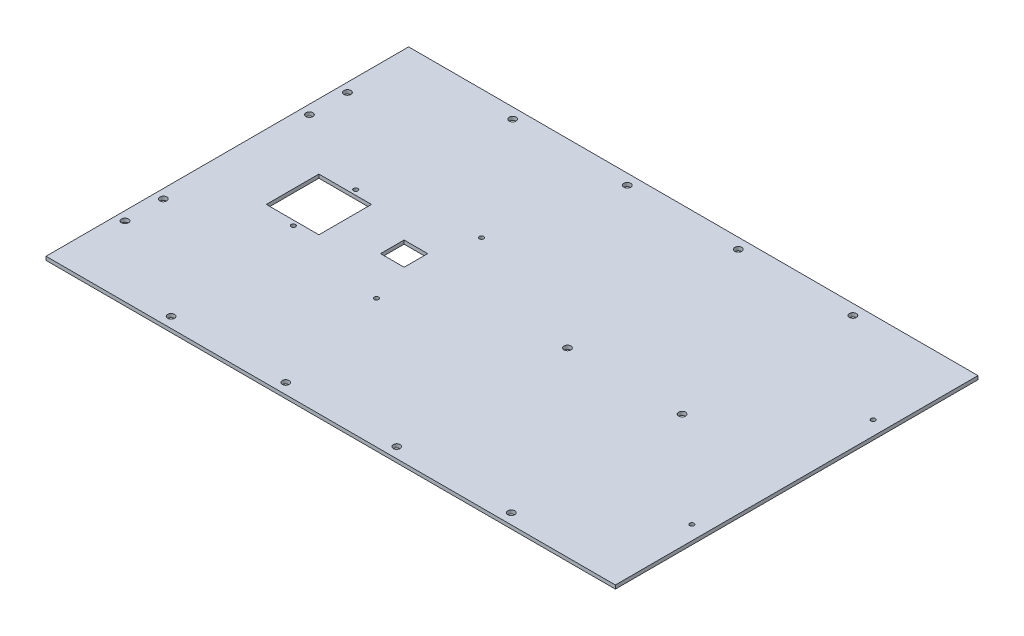
ISO-10303-21;
HEADER;
FILE_DESCRIPTION(('STEP AP214'),'2;1');
FILE_NAME('part.step','',(''),(''),'','','');
FILE_SCHEMA(('AUTOMOTIVE_DESIGN { 1 0 10303 214 1 1 1 1 }'));
ENDSEC;
DATA;
#1=APPLICATION_CONTEXT('core data for automotive mechanical design processes');
#2=APPLICATION_PROTOCOL_DEFINITION('international standard','automotive_design',2000,#1);
#3=PRODUCT_CONTEXT('',#1,'mechanical');
#4=PRODUCT('Part','Part','',(#3));
#5=PRODUCT_RELATED_PRODUCT_CATEGORY('part','',(#4));
#6=PRODUCT_DEFINITION_FORMATION('','',#4);
#7=PRODUCT_DEFINITION_CONTEXT('part definition',#1,'design');
#8=PRODUCT_DEFINITION('design','',#6,#7);
#9=PRODUCT_DEFINITION_SHAPE('','',#8);
#10=(LENGTH_UNIT() NAMED_UNIT(*) SI_UNIT(.MILLI.,.METRE.));
#11=(NAMED_UNIT(*) PLANE_ANGLE_UNIT() SI_UNIT($,.RADIAN.));
#12=(NAMED_UNIT(*) SI_UNIT($,.STERADIAN.) SOLID_ANGLE_UNIT());
#13=UNCERTAINTY_MEASURE_WITH_UNIT(LENGTH_MEASURE(1.E-05),#10,'distance_accuracy_value','');
#14=(GEOMETRIC_REPRESENTATION_CONTEXT(3) GLOBAL_UNCERTAINTY_ASSIGNED_CONTEXT((#13)) GLOBAL_UNIT_ASSIGNED_CONTEXT((#10,
#11,#12)) REPRESENTATION_CONTEXT('',''));
#15=CARTESIAN_POINT('',(0.,0.,0.));
#16=DIRECTION('',(0.,0.,1.));
#17=DIRECTION('',(1.,0.,0.));
#18=AXIS2_PLACEMENT_3D('',#15,#16,#17);
#19=CARTESIAN_POINT('',(0.,2.54,0.));
#20=DIRECTION('',(0.,1.,0.));
#21=DIRECTION('',(0.,0.,1.));
#22=AXIS2_PLACEMENT_3D('',#19,#20,#21);
#23=PLANE('',#22);
#24=CARTESIAN_POINT('',(189.484,2.54,0.));
#25=DIRECTION('',(0.,1.,0.));
#26=DIRECTION('',(0.,0.,1.));
#27=AXIS2_PLACEMENT_3D('',#24,#25,#26);
#28=CIRCLE('',#27,1.524);
#29=CARTESIAN_POINT('',(189.484,2.54,1.524));
#30=VERTEX_POINT('',#29);
#31=EDGE_CURVE('E613',#30,#30,#28,.T.);
#32=ORIENTED_EDGE('',*,*,#31,.F.);
#33=EDGE_LOOP('',(#32));
#34=FACE_BOUND('',#33,.T.);
#35=CARTESIAN_POINT('',(189.484,2.54,-127.));
#36=DIRECTION('',(0.,1.,0.));
#37=DIRECTION('',(0.,0.,1.));
#38=AXIS2_PLACEMENT_3D('',#35,#36,#37);
#39=CIRCLE('',#38,1.524);
#40=CARTESIAN_POINT('',(189.484,2.54,-125.476));
#41=VERTEX_POINT('',#40);
#42=EDGE_CURVE('E615',#41,#41,#39,.T.);
#43=ORIENTED_EDGE('',*,*,#42,.F.);
#44=EDGE_LOOP('',(#43));
#45=FACE_BOUND('',#44,.T.);
#46=CARTESIAN_POINT('',(-58.1660000000001,2.54,-100.33));
#47=DIRECTION('',(0.,1.,0.));
#48=DIRECTION('',(0.,0.,1.));
#49=AXIS2_PLACEMENT_3D('',#46,#47,#48);
#50=CIRCLE('',#49,1.52399999999998);
#51=CARTESIAN_POINT('',(-58.1660000000001,2.54,-98.8060000000001));
#52=VERTEX_POINT('',#51);
#53=EDGE_CURVE('E623',#52,#52,#50,.T.);
#54=ORIENTED_EDGE('',*,*,#53,.F.);
#55=EDGE_LOOP('',(#54));
#56=FACE_BOUND('',#55,.T.);
#57=CARTESIAN_POINT('',(-58.1660000000001,2.54,-26.6700000000001));
#58=DIRECTION('',(0.,1.,0.));
#59=DIRECTION('',(0.,0.,1.));
#60=AXIS2_PLACEMENT_3D('',#57,#58,#59);
#61=CIRCLE('',#60,1.52399999999998);
#62=CARTESIAN_POINT('',(-58.1660000000001,2.54,-25.1460000000001));
#63=VERTEX_POINT('',#62);
#64=EDGE_CURVE('E629',#63,#63,#61,.T.);
#65=ORIENTED_EDGE('',*,*,#64,.F.);
#66=EDGE_LOOP('',(#65));
#67=FACE_BOUND('',#66,.T.);
#68=CARTESIAN_POINT('',(-131.318,2.54,-41.656));
#69=DIRECTION('',(0.,1.,0.));
#70=DIRECTION('',(0.,0.,1.));
#71=AXIS2_PLACEMENT_3D('',#68,#69,#70);
#72=CIRCLE('',#71,1.524);
#73=CARTESIAN_POINT('',(-131.318,2.54,-40.132));
#74=VERTEX_POINT('',#73);
#75=EDGE_CURVE('E635',#74,#74,#72,.T.);
#76=ORIENTED_EDGE('',*,*,#75,.F.);
#77=EDGE_LOOP('',(#76));
#78=FACE_BOUND('',#77,.T.);
#79=CARTESIAN_POINT('',(-131.318,2.54,-85.344));
#80=DIRECTION('',(0.,1.,0.));
#81=DIRECTION('',(0.,0.,1.));
#82=AXIS2_PLACEMENT_3D('',#79,#80,#81);
#83=CIRCLE('',#82,1.524);
#84=CARTESIAN_POINT('',(-131.318,2.54,-83.82));
#85=VERTEX_POINT('',#84);
#86=EDGE_CURVE('E641',#85,#85,#83,.T.);
#87=ORIENTED_EDGE('',*,*,#86,.F.);
#88=EDGE_LOOP('',(#87));
#89=FACE_BOUND('',#88,.T.);
#90=CARTESIAN_POINT('',(119.126,2.54,-63.5000000000001));
#91=DIRECTION('',(0.,1.,0.));
#92=DIRECTION('',(0.,0.,1.));
#93=AXIS2_PLACEMENT_3D('',#90,#91,#92);
#94=CIRCLE('',#93,2.42569999999999);
#95=CARTESIAN_POINT('',(119.126,2.54,-61.0743000000001));
#96=VERTEX_POINT('',#95);
#97=EDGE_CURVE('E647',#96,#96,#94,.T.);
#98=ORIENTED_EDGE('',*,*,#97,.F.);
#99=EDGE_LOOP('',(#98));
#100=FACE_BOUND('',#99,.T.);
#101=CARTESIAN_POINT('',(38.8619999999999,2.54,-63.5000000000001));
#102=DIRECTION('',(0.,1.,0.));
#103=DIRECTION('',(0.,0.,1.));
#104=AXIS2_PLACEMENT_3D('',#101,#102,#103);
#105=CIRCLE('',#104,2.42569999999999);
#106=CARTESIAN_POINT('',(38.8619999999999,2.54,-61.0743000000001));
#107=VERTEX_POINT('',#106);
#108=EDGE_CURVE('E653',#107,#107,#105,.T.);
#109=ORIENTED_EDGE('',*,*,#108,.F.);
#110=EDGE_LOOP('',(#109));
#111=FACE_BOUND('',#110,.T.);
#112=CARTESIAN_POINT('',(-119.126,2.54,-183.127777467231));
#113=DIRECTION('',(0.,1.,0.));
#114=DIRECTION('',(0.,0.,1.));
#115=AXIS2_PLACEMENT_3D('',#112,#113,#114);
#116=CIRCLE('',#115,2.42569999999999);
#117=CARTESIAN_POINT('',(-119.126,2.54,-180.702077467232));
#118=VERTEX_POINT('',#117);
#119=EDGE_CURVE('E160',#118,#118,#116,.T.);
#120=ORIENTED_EDGE('',*,*,#119,.F.);
#121=EDGE_LOOP('',(#120));
#122=FACE_BOUND('',#121,.T.);
#123=CARTESIAN_POINT('',(-38.8620000000001,2.54,-183.127777467232));
#124=DIRECTION('',(0.,1.,0.));
#125=DIRECTION('',(0.,0.,1.));
#126=AXIS2_PLACEMENT_3D('',#123,#124,#125);
#127=CIRCLE('',#126,2.42569999999999);
#128=CARTESIAN_POINT('',(-38.8620000000001,2.54,-180.702077467232));
#129=VERTEX_POINT('',#128);
#130=EDGE_CURVE('E168',#129,#129,#127,.T.);
#131=ORIENTED_EDGE('',*,*,#130,.F.);
#132=EDGE_LOOP('',(#131));
#133=FACE_BOUND('',#132,.T.);
#134=CARTESIAN_POINT('',(38.8619999999999,2.54,-183.127777467232));
#135=DIRECTION('',(0.,1.,0.));
#136=DIRECTION('',(0.,0.,1.));
#137=AXIS2_PLACEMENT_3D('',#134,#135,#136);
#138=CIRCLE('',#137,2.42569999999999);
#139=CARTESIAN_POINT('',(38.8619999999999,2.54,-180.702077467232));
#140=VERTEX_POINT('',#139);
#141=EDGE_CURVE('E174',#140,#140,#138,.T.);
#142=ORIENTED_EDGE('',*,*,#141,.F.);
#143=EDGE_LOOP('',(#142));
#144=FACE_BOUND('',#143,.T.);
#145=CARTESIAN_POINT('',(119.126,2.54,-183.127777467232));
#146=DIRECTION('',(0.,1.,0.));
#147=DIRECTION('',(0.,0.,1.));
#148=AXIS2_PLACEMENT_3D('',#145,#146,#147);
#149=CIRCLE('',#148,2.42569999999999);
#150=CARTESIAN_POINT('',(119.126,2.54,-180.702077467232));
#151=VERTEX_POINT('',#150);
#152=EDGE_CURVE('E180',#151,#151,#149,.T.);
#153=ORIENTED_EDGE('',*,*,#152,.F.);
#154=EDGE_LOOP('',(#153));
#155=FACE_BOUND('',#154,.T.);
#156=CARTESIAN_POINT('',(-193.167,2.54,-141.4018));
#157=DIRECTION('',(0.,1.,0.));
#158=DIRECTION('',(0.,0.,1.));
#159=AXIS2_PLACEMENT_3D('',#156,#157,#158);
#160=CIRCLE('',#159,2.4257);
#161=CARTESIAN_POINT('',(-193.167,2.54,-138.9761));
#162=VERTEX_POINT('',#161);
#163=EDGE_CURVE('E186',#162,#162,#160,.T.);
#164=ORIENTED_EDGE('',*,*,#163,.F.);
#165=EDGE_LOOP('',(#164));
#166=FACE_BOUND('',#165,.T.);
#167=CARTESIAN_POINT('',(-193.04,2.54,-114.6556));
#168=DIRECTION('',(0.,1.,0.));
#169=DIRECTION('',(0.,0.,1.));
#170=AXIS2_PLACEMENT_3D('',#167,#168,#169);
#171=CIRCLE('',#170,2.4257);
#172=CARTESIAN_POINT('',(-193.04,2.54,-112.2299));
#173=VERTEX_POINT('',#172);
#174=EDGE_CURVE('E192',#173,#173,#171,.T.);
#175=ORIENTED_EDGE('',*,*,#174,.F.);
#176=EDGE_LOOP('',(#175));
#177=FACE_BOUND('',#176,.T.);
#178=DIRECTION('',(0.,0.,1.));
#179=VECTOR('',#178,1.);
#180=CARTESIAN_POINT('',(199.39,2.54,0.));
#181=LINE('',#180,#179);
#182=CARTESIAN_POINT('',(199.39,2.54,-190.5));
#183=VERTEX_POINT('',#182);
#184=CARTESIAN_POINT('',(199.39,2.54,63.5000000000001));
#185=VERTEX_POINT('',#184);
#186=EDGE_CURVE('E285',#183,#185,#181,.T.);
#187=ORIENTED_EDGE('',*,*,#186,.F.);
#188=DIRECTION('',(1.,0.,0.));
#189=VECTOR('',#188,1.);
#190=CARTESIAN_POINT('',(0.,2.54,-190.5));
#191=LINE('',#190,#189);
#192=CARTESIAN_POINT('',(-199.39,2.54,-190.5));
#193=VERTEX_POINT('',#192);
#194=EDGE_CURVE('E199',#193,#183,#191,.T.);
#195=ORIENTED_EDGE('',*,*,#194,.F.);
#196=DIRECTION('',(0.,0.,1.));
#197=VECTOR('',#196,1.);
#198=CARTESIAN_POINT('',(-199.39,2.54,0.));
#199=LINE('',#198,#197);
#200=CARTESIAN_POINT('',(-199.39,2.54,63.5));
#201=VERTEX_POINT('',#200);
#202=EDGE_CURVE('E279',#193,#201,#199,.T.);
#203=ORIENTED_EDGE('',*,*,#202,.T.);
#204=DIRECTION('',(1.,0.,0.));
#205=VECTOR('',#204,1.);
#206=CARTESIAN_POINT('',(0.,2.54,63.5000000000001));
#207=LINE('',#206,#205);
#208=EDGE_CURVE('E282',#201,#185,#207,.T.);
#209=ORIENTED_EDGE('',*,*,#208,.T.);
#210=EDGE_LOOP('',(#187,#195,#203,#209));
#211=FACE_BOUND('',#210,.T.);
#212=CARTESIAN_POINT('',(-119.126,2.54,56.1277774672314));
#213=DIRECTION('',(0.,1.,0.));
#214=DIRECTION('',(0.,0.,1.));
#215=AXIS2_PLACEMENT_3D('',#212,#213,#214);
#216=CIRCLE('',#215,2.42569999999999);
#217=CARTESIAN_POINT('',(-119.126,2.54,58.5534774672314));
#218=VERTEX_POINT('',#217);
#219=EDGE_CURVE('E241',#218,#218,#216,.T.);
#220=ORIENTED_EDGE('',*,*,#219,.F.);
#221=EDGE_LOOP('',(#220));
#222=FACE_BOUND('',#221,.T.);
#223=CARTESIAN_POINT('',(-38.862,2.54,56.1277774672314));
#224=DIRECTION('',(0.,1.,0.));
#225=DIRECTION('',(0.,0.,1.));
#226=AXIS2_PLACEMENT_3D('',#223,#224,#225);
#227=CIRCLE('',#226,2.42569999999999);
#228=CARTESIAN_POINT('',(-38.862,2.54,58.5534774672314));
#229=VERTEX_POINT('',#228);
#230=EDGE_CURVE('E248',#229,#229,#227,.T.);
#231=ORIENTED_EDGE('',*,*,#230,.F.);
#232=EDGE_LOOP('',(#231));
#233=FACE_BOUND('',#232,.T.);
#234=CARTESIAN_POINT('',(38.862,2.54,56.1277774672314));
#235=DIRECTION('',(0.,1.,0.));
#236=DIRECTION('',(0.,0.,1.));
#237=AXIS2_PLACEMENT_3D('',#234,#235,#236);
#238=CIRCLE('',#237,2.42569999999999);
#239=CARTESIAN_POINT('',(38.862,2.54,58.5534774672314));
#240=VERTEX_POINT('',#239);
#241=EDGE_CURVE('E254',#240,#240,#238,.T.);
#242=ORIENTED_EDGE('',*,*,#241,.F.);
#243=EDGE_LOOP('',(#242));
#244=FACE_BOUND('',#243,.T.);
#245=CARTESIAN_POINT('',(119.126,2.54,56.1277774672314));
#246=DIRECTION('',(0.,1.,0.));
#247=DIRECTION('',(0.,0.,1.));
#248=AXIS2_PLACEMENT_3D('',#245,#246,#247);
#249=CIRCLE('',#248,2.42569999999999);
#250=CARTESIAN_POINT('',(119.126,2.54,58.5534774672314));
#251=VERTEX_POINT('',#250);
#252=EDGE_CURVE('E260',#251,#251,#249,.T.);
#253=ORIENTED_EDGE('',*,*,#252,.F.);
#254=EDGE_LOOP('',(#253));
#255=FACE_BOUND('',#254,.T.);
#256=CARTESIAN_POINT('',(-193.167,2.54,14.4018));
#257=DIRECTION('',(0.,1.,0.));
#258=DIRECTION('',(0.,0.,1.));
#259=AXIS2_PLACEMENT_3D('',#256,#257,#258);
#260=CIRCLE('',#259,2.4257);
#261=CARTESIAN_POINT('',(-193.167,2.54,16.8275));
#262=VERTEX_POINT('',#261);
#263=EDGE_CURVE('E266',#262,#262,#260,.T.);
#264=ORIENTED_EDGE('',*,*,#263,.F.);
#265=EDGE_LOOP('',(#264));
#266=FACE_BOUND('',#265,.T.);
#267=CARTESIAN_POINT('',(-193.04,2.54,-12.3444));
#268=DIRECTION('',(0.,1.,0.));
#269=DIRECTION('',(0.,0.,1.));
#270=AXIS2_PLACEMENT_3D('',#267,#268,#269);
#271=CIRCLE('',#270,2.4257);
#272=CARTESIAN_POINT('',(-193.04,2.54,-9.9187));
#273=VERTEX_POINT('',#272);
#274=EDGE_CURVE('E272',#273,#273,#271,.T.);
#275=ORIENTED_EDGE('',*,*,#274,.F.);
#276=EDGE_LOOP('',(#275));
#277=FACE_BOUND('',#276,.T.);
#278=DIRECTION('',(0.,0.,1.));
#279=VECTOR('',#278,1.);
#280=CARTESIAN_POINT('',(-153.67,2.54,-63.5));
#281=LINE('',#280,#279);
#282=CARTESIAN_POINT('',(-153.67,2.54,-81.915));
#283=VERTEX_POINT('',#282);
#284=CARTESIAN_POINT('',(-153.67,2.54,-45.085));
#285=VERTEX_POINT('',#284);
#286=EDGE_CURVE('E222',#283,#285,#281,.T.);
#287=ORIENTED_EDGE('',*,*,#286,.F.);
#288=DIRECTION('',(1.,0.,0.));
#289=VECTOR('',#288,1.);
#290=CARTESIAN_POINT('',(-153.67,2.54,-81.915));
#291=LINE('',#290,#289);
#292=CARTESIAN_POINT('',(-116.84,2.54,-81.9150000000001));
#293=VERTEX_POINT('',#292);
#294=EDGE_CURVE('E147',#283,#293,#291,.T.);
#295=ORIENTED_EDGE('',*,*,#294,.T.);
#296=DIRECTION('',(0.,0.,-1.));
#297=VECTOR('',#296,1.);
#298=CARTESIAN_POINT('',(-116.84,2.54,-63.5));
#299=LINE('',#298,#297);
#300=CARTESIAN_POINT('',(-116.84,2.54,-45.085));
#301=VERTEX_POINT('',#300);
#302=EDGE_CURVE('E228',#301,#293,#299,.T.);
#303=ORIENTED_EDGE('',*,*,#302,.F.);
#304=DIRECTION('',(1.,0.,0.));
#305=VECTOR('',#304,1.);
#306=CARTESIAN_POINT('',(-153.67,2.54,-45.085));
#307=LINE('',#306,#305);
#308=EDGE_CURVE('E235',#285,#301,#307,.T.);
#309=ORIENTED_EDGE('',*,*,#308,.F.);
#310=EDGE_LOOP('',(#287,#295,#303,#309));
#311=FACE_BOUND('',#310,.T.);
#312=DIRECTION('',(0.,0.,1.));
#313=VECTOR('',#312,1.);
#314=CARTESIAN_POINT('',(-83.8200000000001,2.54,-63.5));
#315=LINE('',#314,#313);
#316=CARTESIAN_POINT('',(-83.8200000000001,2.54,-71.7550000000001));
#317=VERTEX_POINT('',#316);
#318=CARTESIAN_POINT('',(-83.8200000000001,2.54,-55.245));
#319=VERTEX_POINT('',#318);
#320=EDGE_CURVE('E210',#317,#319,#315,.T.);
#321=ORIENTED_EDGE('',*,*,#320,.F.);
#322=DIRECTION('',(1.,0.,0.));
#323=VECTOR('',#322,1.);
#324=CARTESIAN_POINT('',(-83.8200000000001,2.54,-71.7550000000001));
#325=LINE('',#324,#323);
#326=CARTESIAN_POINT('',(-67.3100000000001,2.54,-71.7550000000001));
#327=VERTEX_POINT('',#326);
#328=EDGE_CURVE('E141',#317,#327,#325,.T.);
#329=ORIENTED_EDGE('',*,*,#328,.T.);
#330=DIRECTION('',(0.,0.,-1.));
#331=VECTOR('',#330,1.);
#332=CARTESIAN_POINT('',(-67.3100000000001,2.54,-63.5));
#333=LINE('',#332,#331);
#334=CARTESIAN_POINT('',(-67.3100000000001,2.54,-55.245));
#335=VERTEX_POINT('',#334);
#336=EDGE_CURVE('E145',#335,#327,#333,.T.);
#337=ORIENTED_EDGE('',*,*,#336,.F.);
#338=DIRECTION('',(1.,0.,0.));
#339=VECTOR('',#338,1.);
#340=CARTESIAN_POINT('',(-83.8200000000001,2.54,-55.245));
#341=LINE('',#340,#339);
#342=EDGE_CURVE('E216',#319,#335,#341,.T.);
#343=ORIENTED_EDGE('',*,*,#342,.F.);
#344=EDGE_LOOP('',(#321,#329,#337,#343));
#345=FACE_BOUND('',#344,.T.);
#346=ADVANCED_FACE('F35',(#34,#45,#56,#67,#78,#89,#100,#111,#122,#133,#144,#155,#166,#177,#211,
#222,#233,#244,#255,#266,#277,#311,#345),#23,.T.);
#347=CARTESIAN_POINT('',(0.,0.,0.));
#348=DIRECTION('',(0.,1.,0.));
#349=DIRECTION('',(0.,0.,1.));
#350=AXIS2_PLACEMENT_3D('',#347,#348,#349);
#351=PLANE('',#350);
#352=CARTESIAN_POINT('',(189.484,0.,0.));
#353=DIRECTION('',(0.,1.,0.));
#354=DIRECTION('',(0.,0.,1.));
#355=AXIS2_PLACEMENT_3D('',#352,#353,#354);
#356=CIRCLE('',#355,1.524);
#357=CARTESIAN_POINT('',(189.484,0.,1.524));
#358=VERTEX_POINT('',#357);
#359=EDGE_CURVE('E611',#358,#358,#356,.T.);
#360=ORIENTED_EDGE('',*,*,#359,.T.);
#361=EDGE_LOOP('',(#360));
#362=FACE_BOUND('',#361,.T.);
#363=CARTESIAN_POINT('',(189.484,0.,-127.));
#364=DIRECTION('',(0.,1.,0.));
#365=DIRECTION('',(0.,0.,1.));
#366=AXIS2_PLACEMENT_3D('',#363,#364,#365);
#367=CIRCLE('',#366,1.524);
#368=CARTESIAN_POINT('',(189.484,0.,-125.476));
#369=VERTEX_POINT('',#368);
#370=EDGE_CURVE('E620',#369,#369,#367,.T.);
#371=ORIENTED_EDGE('',*,*,#370,.T.);
#372=EDGE_LOOP('',(#371));
#373=FACE_BOUND('',#372,.T.);
#374=CARTESIAN_POINT('',(-58.1660000000001,0.,-100.33));
#375=DIRECTION('',(0.,1.,0.));
#376=DIRECTION('',(0.,0.,1.));
#377=AXIS2_PLACEMENT_3D('',#374,#375,#376);
#378=CIRCLE('',#377,1.524);
#379=CARTESIAN_POINT('',(-58.1660000000001,0.,-98.8060000000001));
#380=VERTEX_POINT('',#379);
#381=EDGE_CURVE('E626',#380,#380,#378,.T.);
#382=ORIENTED_EDGE('',*,*,#381,.T.);
#383=EDGE_LOOP('',(#382));
#384=FACE_BOUND('',#383,.T.);
#385=CARTESIAN_POINT('',(-58.1660000000001,0.,-26.6700000000001));
#386=DIRECTION('',(0.,1.,0.));
#387=DIRECTION('',(0.,0.,1.));
#388=AXIS2_PLACEMENT_3D('',#385,#386,#387);
#389=CIRCLE('',#388,1.524);
#390=CARTESIAN_POINT('',(-58.1660000000001,0.,-25.1460000000001));
#391=VERTEX_POINT('',#390);
#392=EDGE_CURVE('E632',#391,#391,#389,.T.);
#393=ORIENTED_EDGE('',*,*,#392,.T.);
#394=EDGE_LOOP('',(#393));
#395=FACE_BOUND('',#394,.T.);
#396=CARTESIAN_POINT('',(-131.318,0.,-41.656));
#397=DIRECTION('',(0.,1.,0.));
#398=DIRECTION('',(0.,0.,1.));
#399=AXIS2_PLACEMENT_3D('',#396,#397,#398);
#400=CIRCLE('',#399,1.524);
#401=CARTESIAN_POINT('',(-131.318,0.,-40.132));
#402=VERTEX_POINT('',#401);
#403=EDGE_CURVE('E638',#402,#402,#400,.T.);
#404=ORIENTED_EDGE('',*,*,#403,.T.);
#405=EDGE_LOOP('',(#404));
#406=FACE_BOUND('',#405,.T.);
#407=CARTESIAN_POINT('',(-131.318,0.,-85.344));
#408=DIRECTION('',(0.,1.,0.));
#409=DIRECTION('',(0.,0.,1.));
#410=AXIS2_PLACEMENT_3D('',#407,#408,#409);
#411=CIRCLE('',#410,1.524);
#412=CARTESIAN_POINT('',(-131.318,0.,-83.82));
#413=VERTEX_POINT('',#412);
#414=EDGE_CURVE('E644',#413,#413,#411,.T.);
#415=ORIENTED_EDGE('',*,*,#414,.T.);
#416=EDGE_LOOP('',(#415));
#417=FACE_BOUND('',#416,.T.);
#418=CARTESIAN_POINT('',(119.126,0.,-63.5000000000001));
#419=DIRECTION('',(0.,1.,0.));
#420=DIRECTION('',(0.,0.,1.));
#421=AXIS2_PLACEMENT_3D('',#418,#419,#420);
#422=CIRCLE('',#421,2.4257);
#423=CARTESIAN_POINT('',(119.126,0.,-61.0743000000001));
#424=VERTEX_POINT('',#423);
#425=EDGE_CURVE('E650',#424,#424,#422,.T.);
#426=ORIENTED_EDGE('',*,*,#425,.T.);
#427=EDGE_LOOP('',(#426));
#428=FACE_BOUND('',#427,.T.);
#429=CARTESIAN_POINT('',(38.8619999999999,0.,-63.5000000000001));
#430=DIRECTION('',(0.,1.,0.));
#431=DIRECTION('',(0.,0.,1.));
#432=AXIS2_PLACEMENT_3D('',#429,#430,#431);
#433=CIRCLE('',#432,2.4257);
#434=CARTESIAN_POINT('',(38.8619999999999,0.,-61.0743000000001));
#435=VERTEX_POINT('',#434);
#436=EDGE_CURVE('E353',#435,#435,#433,.T.);
#437=ORIENTED_EDGE('',*,*,#436,.T.);
#438=EDGE_LOOP('',(#437));
#439=FACE_BOUND('',#438,.T.);
#440=DIRECTION('',(1.,0.,0.));
#441=VECTOR('',#440,1.);
#442=CARTESIAN_POINT('',(-153.67,0.,-81.915));
#443=LINE('',#442,#441);
#444=CARTESIAN_POINT('',(-153.67,0.,-81.915));
#445=VERTEX_POINT('',#444);
#446=CARTESIAN_POINT('',(-116.84,0.,-81.9150000000001));
#447=VERTEX_POINT('',#446);
#448=EDGE_CURVE('E151',#445,#447,#443,.T.);
#449=ORIENTED_EDGE('',*,*,#448,.F.);
#450=DIRECTION('',(0.,0.,1.));
#451=VECTOR('',#450,1.);
#452=CARTESIAN_POINT('',(-153.67,0.,-63.5));
#453=LINE('',#452,#451);
#454=CARTESIAN_POINT('',(-153.67,0.,-45.085));
#455=VERTEX_POINT('',#454);
#456=EDGE_CURVE('E224',#445,#455,#453,.T.);
#457=ORIENTED_EDGE('',*,*,#456,.T.);
#458=DIRECTION('',(1.,0.,0.));
#459=VECTOR('',#458,1.);
#460=CARTESIAN_POINT('',(-153.67,0.,-45.085));
#461=LINE('',#460,#459);
#462=CARTESIAN_POINT('',(-116.84,0.,-45.085));
#463=VERTEX_POINT('',#462);
#464=EDGE_CURVE('E227',#455,#463,#461,.T.);
#465=ORIENTED_EDGE('',*,*,#464,.T.);
#466=DIRECTION('',(0.,0.,-1.));
#467=VECTOR('',#466,1.);
#468=CARTESIAN_POINT('',(-116.84,0.,-63.5));
#469=LINE('',#468,#467);
#470=EDGE_CURVE('E58',#463,#447,#469,.T.);
#471=ORIENTED_EDGE('',*,*,#470,.T.);
#472=EDGE_LOOP('',(#449,#457,#465,#471));
#473=FACE_BOUND('',#472,.T.);
#474=CARTESIAN_POINT('',(-119.126,0.,-183.127777467231));
#475=DIRECTION('',(0.,1.,0.));
#476=DIRECTION('',(0.,0.,1.));
#477=AXIS2_PLACEMENT_3D('',#474,#475,#476);
#478=CIRCLE('',#477,2.4257);
#479=CARTESIAN_POINT('',(-119.126,0.,-180.702077467232));
#480=VERTEX_POINT('',#479);
#481=EDGE_CURVE('E165',#480,#480,#478,.T.);
#482=ORIENTED_EDGE('',*,*,#481,.T.);
#483=EDGE_LOOP('',(#482));
#484=FACE_BOUND('',#483,.T.);
#485=CARTESIAN_POINT('',(-38.8620000000001,0.,-183.127777467232));
#486=DIRECTION('',(0.,1.,0.));
#487=DIRECTION('',(0.,0.,1.));
#488=AXIS2_PLACEMENT_3D('',#485,#486,#487);
#489=CIRCLE('',#488,2.4257);
#490=CARTESIAN_POINT('',(-38.8620000000001,0.,-180.702077467232));
#491=VERTEX_POINT('',#490);
#492=EDGE_CURVE('E171',#491,#491,#489,.T.);
#493=ORIENTED_EDGE('',*,*,#492,.T.);
#494=EDGE_LOOP('',(#493));
#495=FACE_BOUND('',#494,.T.);
#496=CARTESIAN_POINT('',(38.8619999999999,0.,-183.127777467232));
#497=DIRECTION('',(0.,1.,0.));
#498=DIRECTION('',(0.,0.,1.));
#499=AXIS2_PLACEMENT_3D('',#496,#497,#498);
#500=CIRCLE('',#499,2.4257);
#501=CARTESIAN_POINT('',(38.8619999999999,0.,-180.702077467232));
#502=VERTEX_POINT('',#501);
#503=EDGE_CURVE('E177',#502,#502,#500,.T.);
#504=ORIENTED_EDGE('',*,*,#503,.T.);
#505=EDGE_LOOP('',(#504));
#506=FACE_BOUND('',#505,.T.);
#507=CARTESIAN_POINT('',(119.126,0.,-183.127777467232));
#508=DIRECTION('',(0.,1.,0.));
#509=DIRECTION('',(0.,0.,1.));
#510=AXIS2_PLACEMENT_3D('',#507,#508,#509);
#511=CIRCLE('',#510,2.4257);
#512=CARTESIAN_POINT('',(119.126,0.,-180.702077467232));
#513=VERTEX_POINT('',#512);
#514=EDGE_CURVE('E183',#513,#513,#511,.T.);
#515=ORIENTED_EDGE('',*,*,#514,.T.);
#516=EDGE_LOOP('',(#515));
#517=FACE_BOUND('',#516,.T.);
#518=CARTESIAN_POINT('',(-193.167,0.,-141.4018));
#519=DIRECTION('',(0.,1.,0.));
#520=DIRECTION('',(0.,0.,1.));
#521=AXIS2_PLACEMENT_3D('',#518,#519,#520);
#522=CIRCLE('',#521,2.4257);
#523=CARTESIAN_POINT('',(-193.167,0.,-138.9761));
#524=VERTEX_POINT('',#523);
#525=EDGE_CURVE('E189',#524,#524,#522,.T.);
#526=ORIENTED_EDGE('',*,*,#525,.T.);
#527=EDGE_LOOP('',(#526));
#528=FACE_BOUND('',#527,.T.);
#529=CARTESIAN_POINT('',(-193.04,0.,-114.6556));
#530=DIRECTION('',(0.,1.,0.));
#531=DIRECTION('',(0.,0.,1.));
#532=AXIS2_PLACEMENT_3D('',#529,#530,#531);
#533=CIRCLE('',#532,2.4257);
#534=CARTESIAN_POINT('',(-193.04,0.,-112.2299));
#535=VERTEX_POINT('',#534);
#536=EDGE_CURVE('E195',#535,#535,#533,.T.);
#537=ORIENTED_EDGE('',*,*,#536,.T.);
#538=EDGE_LOOP('',(#537));
#539=FACE_BOUND('',#538,.T.);
#540=DIRECTION('',(1.,0.,0.));
#541=VECTOR('',#540,1.);
#542=CARTESIAN_POINT('',(0.,0.,-190.5));
#543=LINE('',#542,#541);
#544=CARTESIAN_POINT('',(-199.39,0.,-190.5));
#545=VERTEX_POINT('',#544);
#546=CARTESIAN_POINT('',(199.39,0.,-190.5));
#547=VERTEX_POINT('',#546);
#548=EDGE_CURVE('E198',#545,#547,#543,.T.);
#549=ORIENTED_EDGE('',*,*,#548,.T.);
#550=DIRECTION('',(0.,0.,1.));
#551=VECTOR('',#550,1.);
#552=CARTESIAN_POINT('',(199.39,0.,0.));
#553=LINE('',#552,#551);
#554=CARTESIAN_POINT('',(199.39,0.,63.5000000000001));
#555=VERTEX_POINT('',#554);
#556=EDGE_CURVE('E283',#547,#555,#553,.T.);
#557=ORIENTED_EDGE('',*,*,#556,.T.);
#558=DIRECTION('',(1.,0.,0.));
#559=VECTOR('',#558,1.);
#560=CARTESIAN_POINT('',(0.,0.,63.5000000000001));
#561=LINE('',#560,#559);
#562=CARTESIAN_POINT('',(-199.39,0.,63.5));
#563=VERTEX_POINT('',#562);
#564=EDGE_CURVE('E290',#563,#555,#561,.T.);
#565=ORIENTED_EDGE('',*,*,#564,.F.);
#566=DIRECTION('',(0.,0.,1.));
#567=VECTOR('',#566,1.);
#568=CARTESIAN_POINT('',(-199.39,0.,0.));
#569=LINE('',#568,#567);
#570=EDGE_CURVE('E278',#545,#563,#569,.T.);
#571=ORIENTED_EDGE('',*,*,#570,.F.);
#572=EDGE_LOOP('',(#549,#557,#565,#571));
#573=FACE_BOUND('',#572,.T.);
#574=CARTESIAN_POINT('',(-119.126,0.,56.1277774672314));
#575=DIRECTION('',(0.,1.,0.));
#576=DIRECTION('',(0.,0.,1.));
#577=AXIS2_PLACEMENT_3D('',#574,#575,#576);
#578=CIRCLE('',#577,2.4257);
#579=CARTESIAN_POINT('',(-119.126,0.,58.5534774672314));
#580=VERTEX_POINT('',#579);
#581=EDGE_CURVE('E245',#580,#580,#578,.T.);
#582=ORIENTED_EDGE('',*,*,#581,.T.);
#583=EDGE_LOOP('',(#582));
#584=FACE_BOUND('',#583,.T.);
#585=CARTESIAN_POINT('',(-38.862,0.,56.1277774672314));
#586=DIRECTION('',(0.,1.,0.));
#587=DIRECTION('',(0.,0.,1.));
#588=AXIS2_PLACEMENT_3D('',#585,#586,#587);
#589=CIRCLE('',#588,2.4257);
#590=CARTESIAN_POINT('',(-38.862,0.,58.5534774672314));
#591=VERTEX_POINT('',#590);
#592=EDGE_CURVE('E251',#591,#591,#589,.T.);
#593=ORIENTED_EDGE('',*,*,#592,.T.);
#594=EDGE_LOOP('',(#593));
#595=FACE_BOUND('',#594,.T.);
#596=CARTESIAN_POINT('',(38.862,0.,56.1277774672314));
#597=DIRECTION('',(0.,1.,0.));
#598=DIRECTION('',(0.,0.,1.));
#599=AXIS2_PLACEMENT_3D('',#596,#597,#598);
#600=CIRCLE('',#599,2.4257);
#601=CARTESIAN_POINT('',(38.862,0.,58.5534774672314));
#602=VERTEX_POINT('',#601);
#603=EDGE_CURVE('E257',#602,#602,#600,.T.);
#604=ORIENTED_EDGE('',*,*,#603,.T.);
#605=EDGE_LOOP('',(#604));
#606=FACE_BOUND('',#605,.T.);
#607=CARTESIAN_POINT('',(119.126,0.,56.1277774672314));
#608=DIRECTION('',(0.,1.,0.));
#609=DIRECTION('',(0.,0.,1.));
#610=AXIS2_PLACEMENT_3D('',#607,#608,#609);
#611=CIRCLE('',#610,2.4257);
#612=CARTESIAN_POINT('',(119.126,0.,58.5534774672314));
#613=VERTEX_POINT('',#612);
#614=EDGE_CURVE('E263',#613,#613,#611,.T.);
#615=ORIENTED_EDGE('',*,*,#614,.T.);
#616=EDGE_LOOP('',(#615));
#617=FACE_BOUND('',#616,.T.);
#618=CARTESIAN_POINT('',(-193.167,0.,14.4018));
#619=DIRECTION('',(0.,1.,0.));
#620=DIRECTION('',(0.,0.,1.));
#621=AXIS2_PLACEMENT_3D('',#618,#619,#620);
#622=CIRCLE('',#621,2.4257);
#623=CARTESIAN_POINT('',(-193.167,0.,16.8275));
#624=VERTEX_POINT('',#623);
#625=EDGE_CURVE('E269',#624,#624,#622,.T.);
#626=ORIENTED_EDGE('',*,*,#625,.T.);
#627=EDGE_LOOP('',(#626));
#628=FACE_BOUND('',#627,.T.);
#629=CARTESIAN_POINT('',(-193.04,0.,-12.3444));
#630=DIRECTION('',(0.,1.,0.));
#631=DIRECTION('',(0.,0.,1.));
#632=AXIS2_PLACEMENT_3D('',#629,#630,#631);
#633=CIRCLE('',#632,2.4257);
#634=CARTESIAN_POINT('',(-193.04,0.,-9.9187));
#635=VERTEX_POINT('',#634);
#636=EDGE_CURVE('E275',#635,#635,#633,.T.);
#637=ORIENTED_EDGE('',*,*,#636,.T.);
#638=EDGE_LOOP('',(#637));
#639=FACE_BOUND('',#638,.T.);
#640=DIRECTION('',(1.,0.,0.));
#641=VECTOR('',#640,1.);
#642=CARTESIAN_POINT('',(-83.8200000000001,0.,-71.7550000000001));
#643=LINE('',#642,#641);
#644=CARTESIAN_POINT('',(-83.8200000000001,0.,-71.7550000000001));
#645=VERTEX_POINT('',#644);
#646=CARTESIAN_POINT('',(-67.3100000000001,0.,-71.7550000000001));
#647=VERTEX_POINT('',#646);
#648=EDGE_CURVE('E127',#645,#647,#643,.T.);
#649=ORIENTED_EDGE('',*,*,#648,.F.);
#650=DIRECTION('',(0.,0.,1.));
#651=VECTOR('',#650,1.);
#652=CARTESIAN_POINT('',(-83.8200000000001,0.,-63.5));
#653=LINE('',#652,#651);
#654=CARTESIAN_POINT('',(-83.8200000000001,0.,-55.245));
#655=VERTEX_POINT('',#654);
#656=EDGE_CURVE('E211',#645,#655,#653,.T.);
#657=ORIENTED_EDGE('',*,*,#656,.T.);
#658=DIRECTION('',(1.,0.,0.));
#659=VECTOR('',#658,1.);
#660=CARTESIAN_POINT('',(-83.8200000000001,0.,-55.245));
#661=LINE('',#660,#659);
#662=CARTESIAN_POINT('',(-67.3100000000001,0.,-55.245));
#663=VERTEX_POINT('',#662);
#664=EDGE_CURVE('E129',#655,#663,#661,.T.);
#665=ORIENTED_EDGE('',*,*,#664,.T.);
#666=DIRECTION('',(0.,0.,-1.));
#667=VECTOR('',#666,1.);
#668=CARTESIAN_POINT('',(-67.3100000000001,0.,-63.5));
#669=LINE('',#668,#667);
#670=EDGE_CURVE('E50',#663,#647,#669,.T.);
#671=ORIENTED_EDGE('',*,*,#670,.T.);
#672=EDGE_LOOP('',(#649,#657,#665,#671));
#673=FACE_BOUND('',#672,.T.);
#674=ADVANCED_FACE('F125',(#362,#373,#384,#395,#406,#417,#428,#439,#473,#484,#495,#506,#517,
#528,#539,#573,#584,#595,#606,#617,#628,#639,#673),#351,.F.);
#675=CARTESIAN_POINT('',(-199.39,2.54,0.));
#676=DIRECTION('',(1.,0.,0.));
#677=DIRECTION('',(0.,0.,-1.));
#678=AXIS2_PLACEMENT_3D('',#675,#676,#677);
#679=PLANE('',#678);
#680=ORIENTED_EDGE('',*,*,#570,.T.);
#681=DIRECTION('',(0.,-1.,0.));
#682=VECTOR('',#681,1.);
#683=CARTESIAN_POINT('',(-199.39,2.54,63.5));
#684=LINE('',#683,#682);
#685=EDGE_CURVE('E11',#201,#563,#684,.T.);
#686=ORIENTED_EDGE('',*,*,#685,.F.);
#687=ORIENTED_EDGE('',*,*,#202,.F.);
#688=DIRECTION('',(0.,-1.,0.));
#689=VECTOR('',#688,1.);
#690=CARTESIAN_POINT('',(-199.39,2.54,-190.5));
#691=LINE('',#690,#689);
#692=EDGE_CURVE('E202',#193,#545,#691,.T.);
#693=ORIENTED_EDGE('',*,*,#692,.T.);
#694=EDGE_LOOP('',(#680,#686,#687,#693));
#695=FACE_BOUND('',#694,.T.);
#696=ADVANCED_FACE('F37',(#695),#679,.F.);
#697=CARTESIAN_POINT('',(0.,2.54,63.5000000000001));
#698=DIRECTION('',(0.,0.,-1.));
#699=DIRECTION('',(-1.,0.,0.));
#700=AXIS2_PLACEMENT_3D('',#697,#698,#699);
#701=PLANE('',#700);
#702=ORIENTED_EDGE('',*,*,#564,.T.);
#703=DIRECTION('',(0.,-1.,0.));
#704=VECTOR('',#703,1.);
#705=CARTESIAN_POINT('',(199.39,2.54,63.5000000000001));
#706=LINE('',#705,#704);
#707=EDGE_CURVE('E43',#185,#555,#706,.T.);
#708=ORIENTED_EDGE('',*,*,#707,.F.);
#709=ORIENTED_EDGE('',*,*,#208,.F.);
#710=ORIENTED_EDGE('',*,*,#685,.T.);
#711=EDGE_LOOP('',(#702,#708,#709,#710));
#712=FACE_BOUND('',#711,.T.);
#713=ADVANCED_FACE('F299',(#712),#701,.F.);
#714=CARTESIAN_POINT('',(199.39,2.54,0.));
#715=DIRECTION('',(1.,0.,0.));
#716=DIRECTION('',(0.,0.,-1.));
#717=AXIS2_PLACEMENT_3D('',#714,#715,#716);
#718=PLANE('',#717);
#719=ORIENTED_EDGE('',*,*,#556,.F.);
#720=DIRECTION('',(0.,-1.,0.));
#721=VECTOR('',#720,1.);
#722=CARTESIAN_POINT('',(199.39,2.54,-190.5));
#723=LINE('',#722,#721);
#724=EDGE_CURVE('E207',#183,#547,#723,.T.);
#725=ORIENTED_EDGE('',*,*,#724,.F.);
#726=ORIENTED_EDGE('',*,*,#186,.T.);
#727=ORIENTED_EDGE('',*,*,#707,.T.);
#728=EDGE_LOOP('',(#719,#725,#726,#727));
#729=FACE_BOUND('',#728,.T.);
#730=ADVANCED_FACE('F296',(#729),#718,.T.);
#731=CARTESIAN_POINT('',(-193.04,2.54,-12.3444));
#732=DIRECTION('',(0.,1.,0.));
#733=DIRECTION('',(0.,0.,1.));
#734=AXIS2_PLACEMENT_3D('',#731,#732,#733);
#735=CYLINDRICAL_SURFACE('',#734,2.4257);
#736=ORIENTED_EDGE('',*,*,#636,.F.);
#737=EDGE_LOOP('',(#736));
#738=FACE_BOUND('',#737,.T.);
#739=ORIENTED_EDGE('',*,*,#274,.T.);
#740=EDGE_LOOP('',(#739));
#741=FACE_BOUND('',#740,.T.);
#742=ADVANCED_FACE('F329',(#738,#741),#735,.F.);
#743=CARTESIAN_POINT('',(-193.167,2.54,14.4018));
#744=DIRECTION('',(0.,1.,0.));
#745=DIRECTION('',(0.,0.,1.));
#746=AXIS2_PLACEMENT_3D('',#743,#744,#745);
#747=CYLINDRICAL_SURFACE('',#746,2.4257);
#748=ORIENTED_EDGE('',*,*,#625,.F.);
#749=EDGE_LOOP('',(#748));
#750=FACE_BOUND('',#749,.T.);
#751=ORIENTED_EDGE('',*,*,#263,.T.);
#752=EDGE_LOOP('',(#751));
#753=FACE_BOUND('',#752,.T.);
#754=ADVANCED_FACE('F336',(#750,#753),#747,.F.);
#755=CARTESIAN_POINT('',(119.126,2.54,56.1277774672314));
#756=DIRECTION('',(0.,1.,0.));
#757=DIRECTION('',(0.,0.,1.));
#758=AXIS2_PLACEMENT_3D('',#755,#756,#757);
#759=CYLINDRICAL_SURFACE('',#758,2.4257);
#760=ORIENTED_EDGE('',*,*,#614,.F.);
#761=EDGE_LOOP('',(#760));
#762=FACE_BOUND('',#761,.T.);
#763=ORIENTED_EDGE('',*,*,#252,.T.);
#764=EDGE_LOOP('',(#763));
#765=FACE_BOUND('',#764,.T.);
#766=ADVANCED_FACE('F341',(#762,#765),#759,.F.);
#767=CARTESIAN_POINT('',(38.862,2.54,56.1277774672314));
#768=DIRECTION('',(0.,1.,0.));
#769=DIRECTION('',(0.,0.,1.));
#770=AXIS2_PLACEMENT_3D('',#767,#768,#769);
#771=CYLINDRICAL_SURFACE('',#770,2.42569999999999);
#772=ORIENTED_EDGE('',*,*,#603,.F.);
#773=EDGE_LOOP('',(#772));
#774=FACE_BOUND('',#773,.T.);
#775=ORIENTED_EDGE('',*,*,#241,.T.);
#776=EDGE_LOOP('',(#775));
#777=FACE_BOUND('',#776,.T.);
#778=ADVANCED_FACE('F387',(#774,#777),#771,.F.);
#779=CARTESIAN_POINT('',(-38.862,2.54,56.1277774672314));
#780=DIRECTION('',(0.,1.,0.));
#781=DIRECTION('',(0.,0.,1.));
#782=AXIS2_PLACEMENT_3D('',#779,#780,#781);
#783=CYLINDRICAL_SURFACE('',#782,2.42569999999999);
#784=ORIENTED_EDGE('',*,*,#592,.F.);
#785=EDGE_LOOP('',(#784));
#786=FACE_BOUND('',#785,.T.);
#787=ORIENTED_EDGE('',*,*,#230,.T.);
#788=EDGE_LOOP('',(#787));
#789=FACE_BOUND('',#788,.T.);
#790=ADVANCED_FACE('F383',(#786,#789),#783,.F.);
#791=CARTESIAN_POINT('',(-119.126,2.54,56.1277774672314));
#792=DIRECTION('',(0.,1.,0.));
#793=DIRECTION('',(0.,0.,1.));
#794=AXIS2_PLACEMENT_3D('',#791,#792,#793);
#795=CYLINDRICAL_SURFACE('',#794,2.4257);
#796=ORIENTED_EDGE('',*,*,#581,.F.);
#797=EDGE_LOOP('',(#796));
#798=FACE_BOUND('',#797,.T.);
#799=ORIENTED_EDGE('',*,*,#219,.T.);
#800=EDGE_LOOP('',(#799));
#801=FACE_BOUND('',#800,.T.);
#802=ADVANCED_FACE('F379',(#798,#801),#795,.F.);
#803=CARTESIAN_POINT('',(-153.67,0.,-63.5));
#804=DIRECTION('',(-1.,0.,0.));
#805=DIRECTION('',(0.,0.,1.));
#806=AXIS2_PLACEMENT_3D('',#803,#804,#805);
#807=PLANE('',#806);
#808=ORIENTED_EDGE('',*,*,#286,.T.);
#809=DIRECTION('',(0.,1.,0.));
#810=VECTOR('',#809,1.);
#811=CARTESIAN_POINT('',(-153.67,0.,-45.085));
#812=LINE('',#811,#810);
#813=EDGE_CURVE('E232',#455,#285,#812,.T.);
#814=ORIENTED_EDGE('',*,*,#813,.F.);
#815=ORIENTED_EDGE('',*,*,#456,.F.);
#816=DIRECTION('',(0.,1.,0.));
#817=VECTOR('',#816,1.);
#818=CARTESIAN_POINT('',(-153.67,0.,-81.915));
#819=LINE('',#818,#817);
#820=EDGE_CURVE('E157',#445,#283,#819,.T.);
#821=ORIENTED_EDGE('',*,*,#820,.T.);
#822=EDGE_LOOP('',(#808,#814,#815,#821));
#823=FACE_BOUND('',#822,.T.);
#824=ADVANCED_FACE('F373',(#823),#807,.F.);
#825=CARTESIAN_POINT('',(-116.84,0.,-63.5));
#826=DIRECTION('',(1.,0.,0.));
#827=DIRECTION('',(0.,0.,-1.));
#828=AXIS2_PLACEMENT_3D('',#825,#826,#827);
#829=PLANE('',#828);
#830=ORIENTED_EDGE('',*,*,#302,.T.);
#831=DIRECTION('',(0.,1.,0.));
#832=VECTOR('',#831,1.);
#833=CARTESIAN_POINT('',(-116.84,0.,-81.9150000000001));
#834=LINE('',#833,#832);
#835=EDGE_CURVE('E154',#447,#293,#834,.T.);
#836=ORIENTED_EDGE('',*,*,#835,.F.);
#837=ORIENTED_EDGE('',*,*,#470,.F.);
#838=DIRECTION('',(0.,1.,0.));
#839=VECTOR('',#838,1.);
#840=CARTESIAN_POINT('',(-116.84,0.,-45.085));
#841=LINE('',#840,#839);
#842=EDGE_CURVE('E239',#463,#301,#841,.T.);
#843=ORIENTED_EDGE('',*,*,#842,.T.);
#844=EDGE_LOOP('',(#830,#836,#837,#843));
#845=FACE_BOUND('',#844,.T.);
#846=ADVANCED_FACE('F370',(#845),#829,.F.);
#847=CARTESIAN_POINT('',(-153.67,0.,-45.085));
#848=DIRECTION('',(0.,0.,1.));
#849=DIRECTION('',(1.,0.,0.));
#850=AXIS2_PLACEMENT_3D('',#847,#848,#849);
#851=PLANE('',#850);
#852=ORIENTED_EDGE('',*,*,#308,.T.);
#853=ORIENTED_EDGE('',*,*,#842,.F.);
#854=ORIENTED_EDGE('',*,*,#464,.F.);
#855=ORIENTED_EDGE('',*,*,#813,.T.);
#856=EDGE_LOOP('',(#852,#853,#854,#855));
#857=FACE_BOUND('',#856,.T.);
#858=ADVANCED_FACE('F369',(#857),#851,.F.);
#859=CARTESIAN_POINT('',(-83.8200000000001,0.,-63.5));
#860=DIRECTION('',(-1.,0.,0.));
#861=DIRECTION('',(0.,0.,1.));
#862=AXIS2_PLACEMENT_3D('',#859,#860,#861);
#863=PLANE('',#862);
#864=ORIENTED_EDGE('',*,*,#320,.T.);
#865=DIRECTION('',(0.,1.,0.));
#866=VECTOR('',#865,1.);
#867=CARTESIAN_POINT('',(-83.8200000000001,0.,-55.245));
#868=LINE('',#867,#866);
#869=EDGE_CURVE('E130',#655,#319,#868,.T.);
#870=ORIENTED_EDGE('',*,*,#869,.F.);
#871=ORIENTED_EDGE('',*,*,#656,.F.);
#872=DIRECTION('',(0.,1.,0.));
#873=VECTOR('',#872,1.);
#874=CARTESIAN_POINT('',(-83.8200000000001,0.,-71.7550000000001));
#875=LINE('',#874,#873);
#876=EDGE_CURVE('E140',#645,#317,#875,.T.);
#877=ORIENTED_EDGE('',*,*,#876,.T.);
#878=EDGE_LOOP('',(#864,#870,#871,#877));
#879=FACE_BOUND('',#878,.T.);
#880=ADVANCED_FACE('F354',(#879),#863,.F.);
#881=CARTESIAN_POINT('',(-67.3100000000001,0.,-63.5));
#882=DIRECTION('',(1.,0.,0.));
#883=DIRECTION('',(0.,0.,-1.));
#884=AXIS2_PLACEMENT_3D('',#881,#882,#883);
#885=PLANE('',#884);
#886=ORIENTED_EDGE('',*,*,#336,.T.);
#887=DIRECTION('',(0.,1.,0.));
#888=VECTOR('',#887,1.);
#889=CARTESIAN_POINT('',(-67.3100000000001,0.,-71.7550000000001));
#890=LINE('',#889,#888);
#891=EDGE_CURVE('E137',#647,#327,#890,.T.);
#892=ORIENTED_EDGE('',*,*,#891,.F.);
#893=ORIENTED_EDGE('',*,*,#670,.F.);
#894=DIRECTION('',(0.,1.,0.));
#895=VECTOR('',#894,1.);
#896=CARTESIAN_POINT('',(-67.3100000000001,0.,-55.245));
#897=LINE('',#896,#895);
#898=EDGE_CURVE('E220',#663,#335,#897,.T.);
#899=ORIENTED_EDGE('',*,*,#898,.T.);
#900=EDGE_LOOP('',(#886,#892,#893,#899));
#901=FACE_BOUND('',#900,.T.);
#902=ADVANCED_FACE('F143',(#901),#885,.F.);
#903=CARTESIAN_POINT('',(-83.8200000000001,0.,-55.245));
#904=DIRECTION('',(0.,0.,1.));
#905=DIRECTION('',(1.,0.,0.));
#906=AXIS2_PLACEMENT_3D('',#903,#904,#905);
#907=PLANE('',#906);
#908=ORIENTED_EDGE('',*,*,#342,.T.);
#909=ORIENTED_EDGE('',*,*,#898,.F.);
#910=ORIENTED_EDGE('',*,*,#664,.F.);
#911=ORIENTED_EDGE('',*,*,#869,.T.);
#912=EDGE_LOOP('',(#908,#909,#910,#911));
#913=FACE_BOUND('',#912,.T.);
#914=ADVANCED_FACE('F356',(#913),#907,.F.);
#915=CARTESIAN_POINT('',(0.,2.54,-190.5));
#916=DIRECTION('',(0.,0.,-1.));
#917=DIRECTION('',(-1.,0.,0.));
#918=AXIS2_PLACEMENT_3D('',#915,#916,#917);
#919=PLANE('',#918);
#920=ORIENTED_EDGE('',*,*,#548,.F.);
#921=ORIENTED_EDGE('',*,*,#692,.F.);
#922=ORIENTED_EDGE('',*,*,#194,.T.);
#923=ORIENTED_EDGE('',*,*,#724,.T.);
#924=EDGE_LOOP('',(#920,#921,#922,#923));
#925=FACE_BOUND('',#924,.T.);
#926=ADVANCED_FACE('F306',(#925),#919,.T.);
#927=CARTESIAN_POINT('',(-193.04,2.54,-114.6556));
#928=DIRECTION('',(0.,1.,0.));
#929=DIRECTION('',(0.,0.,1.));
#930=AXIS2_PLACEMENT_3D('',#927,#928,#929);
#931=CYLINDRICAL_SURFACE('',#930,2.4257);
#932=ORIENTED_EDGE('',*,*,#536,.F.);
#933=EDGE_LOOP('',(#932));
#934=FACE_BOUND('',#933,.T.);
#935=ORIENTED_EDGE('',*,*,#174,.T.);
#936=EDGE_LOOP('',(#935));
#937=FACE_BOUND('',#936,.T.);
#938=ADVANCED_FACE('F363',(#934,#937),#931,.F.);
#939=CARTESIAN_POINT('',(-193.167,2.54,-141.4018));
#940=DIRECTION('',(0.,1.,0.));
#941=DIRECTION('',(0.,0.,1.));
#942=AXIS2_PLACEMENT_3D('',#939,#940,#941);
#943=CYLINDRICAL_SURFACE('',#942,2.4257);
#944=ORIENTED_EDGE('',*,*,#525,.F.);
#945=EDGE_LOOP('',(#944));
#946=FACE_BOUND('',#945,.T.);
#947=ORIENTED_EDGE('',*,*,#163,.T.);
#948=EDGE_LOOP('',(#947));
#949=FACE_BOUND('',#948,.T.);
#950=ADVANCED_FACE('F457',(#946,#949),#943,.F.);
#951=CARTESIAN_POINT('',(119.126,2.54,-183.127777467232));
#952=DIRECTION('',(0.,1.,0.));
#953=DIRECTION('',(0.,0.,1.));
#954=AXIS2_PLACEMENT_3D('',#951,#952,#953);
#955=CYLINDRICAL_SURFACE('',#954,2.4257);
#956=ORIENTED_EDGE('',*,*,#514,.F.);
#957=EDGE_LOOP('',(#956));
#958=FACE_BOUND('',#957,.T.);
#959=ORIENTED_EDGE('',*,*,#152,.T.);
#960=EDGE_LOOP('',(#959));
#961=FACE_BOUND('',#960,.T.);
#962=ADVANCED_FACE('F467',(#958,#961),#955,.F.);
#963=CARTESIAN_POINT('',(38.8619999999999,2.54,-183.127777467232));
#964=DIRECTION('',(0.,1.,0.));
#965=DIRECTION('',(0.,0.,1.));
#966=AXIS2_PLACEMENT_3D('',#963,#964,#965);
#967=CYLINDRICAL_SURFACE('',#966,2.42569999999999);
#968=ORIENTED_EDGE('',*,*,#503,.F.);
#969=EDGE_LOOP('',(#968));
#970=FACE_BOUND('',#969,.T.);
#971=ORIENTED_EDGE('',*,*,#141,.T.);
#972=EDGE_LOOP('',(#971));
#973=FACE_BOUND('',#972,.T.);
#974=ADVANCED_FACE('F477',(#970,#973),#967,.F.);
#975=CARTESIAN_POINT('',(-38.8620000000001,2.54,-183.127777467232));
#976=DIRECTION('',(0.,1.,0.));
#977=DIRECTION('',(0.,0.,1.));
#978=AXIS2_PLACEMENT_3D('',#975,#976,#977);
#979=CYLINDRICAL_SURFACE('',#978,2.42569999999999);
#980=ORIENTED_EDGE('',*,*,#492,.F.);
#981=EDGE_LOOP('',(#980));
#982=FACE_BOUND('',#981,.T.);
#983=ORIENTED_EDGE('',*,*,#130,.T.);
#984=EDGE_LOOP('',(#983));
#985=FACE_BOUND('',#984,.T.);
#986=ADVANCED_FACE('F487',(#982,#985),#979,.F.);
#987=CARTESIAN_POINT('',(-119.126,2.54,-183.127777467231));
#988=DIRECTION('',(0.,1.,0.));
#989=DIRECTION('',(0.,0.,1.));
#990=AXIS2_PLACEMENT_3D('',#987,#988,#989);
#991=CYLINDRICAL_SURFACE('',#990,2.4257);
#992=ORIENTED_EDGE('',*,*,#481,.F.);
#993=EDGE_LOOP('',(#992));
#994=FACE_BOUND('',#993,.T.);
#995=ORIENTED_EDGE('',*,*,#119,.T.);
#996=EDGE_LOOP('',(#995));
#997=FACE_BOUND('',#996,.T.);
#998=ADVANCED_FACE('F497',(#994,#997),#991,.F.);
#999=CARTESIAN_POINT('',(-153.67,0.,-81.915));
#1000=DIRECTION('',(0.,0.,1.));
#1001=DIRECTION('',(1.,0.,0.));
#1002=AXIS2_PLACEMENT_3D('',#999,#1000,#1001);
#1003=PLANE('',#1002);
#1004=ORIENTED_EDGE('',*,*,#294,.F.);
#1005=ORIENTED_EDGE('',*,*,#820,.F.);
#1006=ORIENTED_EDGE('',*,*,#448,.T.);
#1007=ORIENTED_EDGE('',*,*,#835,.T.);
#1008=EDGE_LOOP('',(#1004,#1005,#1006,#1007));
#1009=FACE_BOUND('',#1008,.T.);
#1010=ADVANCED_FACE('F507',(#1009),#1003,.T.);
#1011=CARTESIAN_POINT('',(-83.8200000000001,0.,-71.7550000000001));
#1012=DIRECTION('',(0.,0.,1.));
#1013=DIRECTION('',(1.,0.,0.));
#1014=AXIS2_PLACEMENT_3D('',#1011,#1012,#1013);
#1015=PLANE('',#1014);
#1016=ORIENTED_EDGE('',*,*,#328,.F.);
#1017=ORIENTED_EDGE('',*,*,#876,.F.);
#1018=ORIENTED_EDGE('',*,*,#648,.T.);
#1019=ORIENTED_EDGE('',*,*,#891,.T.);
#1020=EDGE_LOOP('',(#1016,#1017,#1018,#1019));
#1021=FACE_BOUND('',#1020,.T.);
#1022=ADVANCED_FACE('F136',(#1021),#1015,.T.);
#1023=CARTESIAN_POINT('',(38.8619999999999,2.54,-63.5000000000001));
#1024=DIRECTION('',(0.,1.,0.));
#1025=DIRECTION('',(0.,0.,1.));
#1026=AXIS2_PLACEMENT_3D('',#1023,#1024,#1025);
#1027=CYLINDRICAL_SURFACE('',#1026,2.42569999999999);
#1028=ORIENTED_EDGE('',*,*,#436,.F.);
#1029=EDGE_LOOP('',(#1028));
#1030=FACE_BOUND('',#1029,.T.);
#1031=ORIENTED_EDGE('',*,*,#108,.T.);
#1032=EDGE_LOOP('',(#1031));
#1033=FACE_BOUND('',#1032,.T.);
#1034=ADVANCED_FACE('F526',(#1030,#1033),#1027,.F.);
#1035=CARTESIAN_POINT('',(119.126,2.54,-63.5000000000001));
#1036=DIRECTION('',(0.,1.,0.));
#1037=DIRECTION('',(0.,0.,1.));
#1038=AXIS2_PLACEMENT_3D('',#1035,#1036,#1037);
#1039=CYLINDRICAL_SURFACE('',#1038,2.4257);
#1040=ORIENTED_EDGE('',*,*,#425,.F.);
#1041=EDGE_LOOP('',(#1040));
#1042=FACE_BOUND('',#1041,.T.);
#1043=ORIENTED_EDGE('',*,*,#97,.T.);
#1044=EDGE_LOOP('',(#1043));
#1045=FACE_BOUND('',#1044,.T.);
#1046=ADVANCED_FACE('F535',(#1042,#1045),#1039,.F.);
#1047=CARTESIAN_POINT('',(-131.318,2.54,-85.344));
#1048=DIRECTION('',(0.,1.,0.));
#1049=DIRECTION('',(0.,0.,1.));
#1050=AXIS2_PLACEMENT_3D('',#1047,#1048,#1049);
#1051=CYLINDRICAL_SURFACE('',#1050,1.524);
#1052=ORIENTED_EDGE('',*,*,#414,.F.);
#1053=EDGE_LOOP('',(#1052));
#1054=FACE_BOUND('',#1053,.T.);
#1055=ORIENTED_EDGE('',*,*,#86,.T.);
#1056=EDGE_LOOP('',(#1055));
#1057=FACE_BOUND('',#1056,.T.);
#1058=ADVANCED_FACE('F545',(#1054,#1057),#1051,.F.);
#1059=CARTESIAN_POINT('',(-131.318,2.54,-41.656));
#1060=DIRECTION('',(0.,1.,0.));
#1061=DIRECTION('',(0.,0.,1.));
#1062=AXIS2_PLACEMENT_3D('',#1059,#1060,#1061);
#1063=CYLINDRICAL_SURFACE('',#1062,1.524);
#1064=ORIENTED_EDGE('',*,*,#403,.F.);
#1065=EDGE_LOOP('',(#1064));
#1066=FACE_BOUND('',#1065,.T.);
#1067=ORIENTED_EDGE('',*,*,#75,.T.);
#1068=EDGE_LOOP('',(#1067));
#1069=FACE_BOUND('',#1068,.T.);
#1070=ADVANCED_FACE('F555',(#1066,#1069),#1063,.F.);
#1071=CARTESIAN_POINT('',(-58.1660000000001,2.54,-26.6700000000001));
#1072=DIRECTION('',(0.,1.,0.));
#1073=DIRECTION('',(0.,0.,1.));
#1074=AXIS2_PLACEMENT_3D('',#1071,#1072,#1073);
#1075=CYLINDRICAL_SURFACE('',#1074,1.52399999999999);
#1076=ORIENTED_EDGE('',*,*,#392,.F.);
#1077=EDGE_LOOP('',(#1076));
#1078=FACE_BOUND('',#1077,.T.);
#1079=ORIENTED_EDGE('',*,*,#64,.T.);
#1080=EDGE_LOOP('',(#1079));
#1081=FACE_BOUND('',#1080,.T.);
#1082=ADVANCED_FACE('F565',(#1078,#1081),#1075,.F.);
#1083=CARTESIAN_POINT('',(-58.1660000000001,2.54,-100.33));
#1084=DIRECTION('',(0.,1.,0.));
#1085=DIRECTION('',(0.,0.,1.));
#1086=AXIS2_PLACEMENT_3D('',#1083,#1084,#1085);
#1087=CYLINDRICAL_SURFACE('',#1086,1.52399999999999);
#1088=ORIENTED_EDGE('',*,*,#381,.F.);
#1089=EDGE_LOOP('',(#1088));
#1090=FACE_BOUND('',#1089,.T.);
#1091=ORIENTED_EDGE('',*,*,#53,.T.);
#1092=EDGE_LOOP('',(#1091));
#1093=FACE_BOUND('',#1092,.T.);
#1094=ADVANCED_FACE('F574',(#1090,#1093),#1087,.F.);
#1095=CARTESIAN_POINT('',(189.484,2.54,-127.));
#1096=DIRECTION('',(0.,1.,0.));
#1097=DIRECTION('',(0.,0.,1.));
#1098=AXIS2_PLACEMENT_3D('',#1095,#1096,#1097);
#1099=CYLINDRICAL_SURFACE('',#1098,1.524);
#1100=ORIENTED_EDGE('',*,*,#370,.F.);
#1101=EDGE_LOOP('',(#1100));
#1102=FACE_BOUND('',#1101,.T.);
#1103=ORIENTED_EDGE('',*,*,#42,.T.);
#1104=EDGE_LOOP('',(#1103));
#1105=FACE_BOUND('',#1104,.T.);
#1106=ADVANCED_FACE('F583',(#1102,#1105),#1099,.F.);
#1107=CARTESIAN_POINT('',(189.484,2.54,0.));
#1108=DIRECTION('',(0.,1.,0.));
#1109=DIRECTION('',(0.,0.,1.));
#1110=AXIS2_PLACEMENT_3D('',#1107,#1108,#1109);
#1111=CYLINDRICAL_SURFACE('',#1110,1.524);
#1112=ORIENTED_EDGE('',*,*,#359,.F.);
#1113=EDGE_LOOP('',(#1112));
#1114=FACE_BOUND('',#1113,.T.);
#1115=ORIENTED_EDGE('',*,*,#31,.T.);
#1116=EDGE_LOOP('',(#1115));
#1117=FACE_BOUND('',#1116,.T.);
#1118=ADVANCED_FACE('F594',(#1114,#1117),#1111,.F.);
#1119=CLOSED_SHELL('',(#346,#674,#696,#713,#730,#742,#754,#766,#778,#790,#802,#824,#846,#858,
#880,#902,#914,#926,#938,#950,#962,#974,#986,#998,#1010,#1022,#1034,#1046,#1058,#1070,#1082,
#1094,#1106,#1118));
#1120=MANIFOLD_SOLID_BREP('B2',#1119);
#1121=ADVANCED_BREP_SHAPE_REPRESENTATION('',(#18,#1120),#14);
#1122=SHAPE_DEFINITION_REPRESENTATION(#9,#1121);
ENDSEC;
END-ISO-10303-21;
